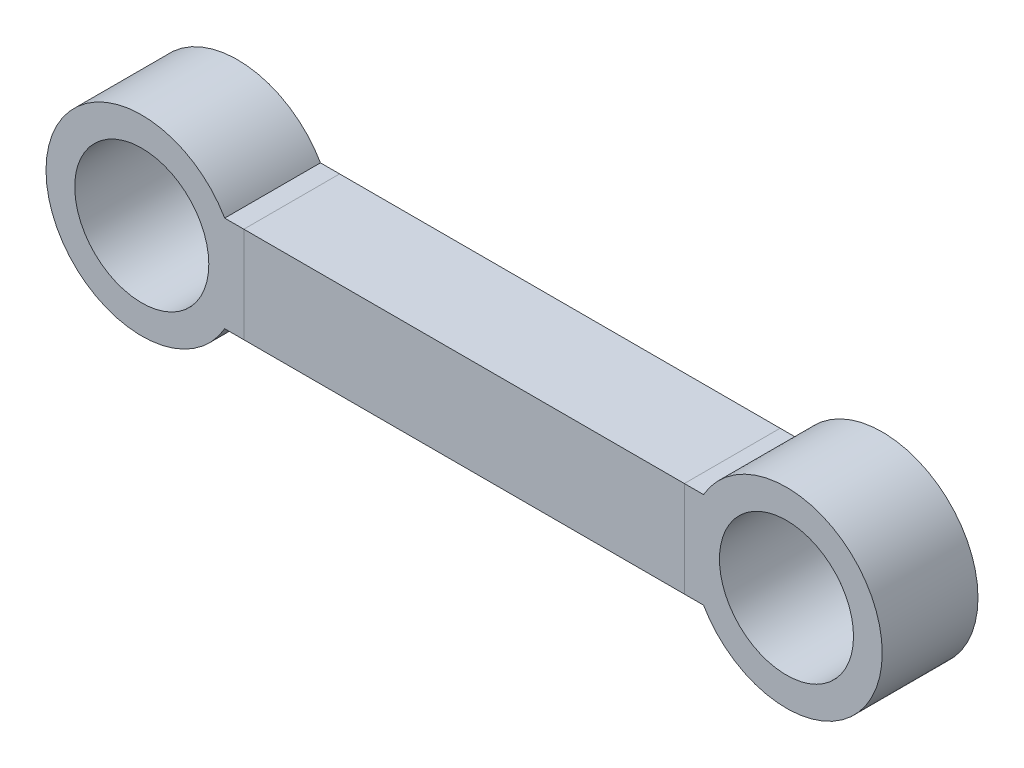
ISO-10303-21;
HEADER;
FILE_DESCRIPTION(('STEP AP214'),'2;1');
FILE_NAME('part.step','',(''),(''),'','','');
FILE_SCHEMA(('AUTOMOTIVE_DESIGN { 1 0 10303 214 1 1 1 1 }'));
ENDSEC;
DATA;
#1=APPLICATION_CONTEXT('core data for automotive mechanical design processes');
#2=APPLICATION_PROTOCOL_DEFINITION('international standard','automotive_design',2000,#1);
#3=PRODUCT_CONTEXT('',#1,'mechanical');
#4=PRODUCT('Part','Part','',(#3));
#5=PRODUCT_RELATED_PRODUCT_CATEGORY('part','',(#4));
#6=PRODUCT_DEFINITION_FORMATION('','',#4);
#7=PRODUCT_DEFINITION_CONTEXT('part definition',#1,'design');
#8=PRODUCT_DEFINITION('design','',#6,#7);
#9=PRODUCT_DEFINITION_SHAPE('','',#8);
#10=(LENGTH_UNIT() NAMED_UNIT(*) SI_UNIT(.MILLI.,.METRE.));
#11=(NAMED_UNIT(*) PLANE_ANGLE_UNIT() SI_UNIT($,.RADIAN.));
#12=(NAMED_UNIT(*) SI_UNIT($,.STERADIAN.) SOLID_ANGLE_UNIT());
#13=UNCERTAINTY_MEASURE_WITH_UNIT(LENGTH_MEASURE(1.E-05),#10,'distance_accuracy_value','');
#14=(GEOMETRIC_REPRESENTATION_CONTEXT(3) GLOBAL_UNCERTAINTY_ASSIGNED_CONTEXT((#13)) GLOBAL_UNIT_ASSIGNED_CONTEXT((#10,
#11,#12)) REPRESENTATION_CONTEXT('',''));
#15=CARTESIAN_POINT('',(0.,0.,0.));
#16=DIRECTION('',(0.,0.,1.));
#17=DIRECTION('',(1.,0.,0.));
#18=AXIS2_PLACEMENT_3D('',#15,#16,#17);
#19=CARTESIAN_POINT('',(23.,0.,10.));
#20=DIRECTION('',(1.,0.,0.));
#21=DIRECTION('',(0.,0.,-1.));
#22=AXIS2_PLACEMENT_3D('',#19,#20,#21);
#23=PLANE('',#22);
#24=DIRECTION('',(0.,-1.,0.));
#25=VECTOR('',#24,1.);
#26=CARTESIAN_POINT('',(23.,0.,0.));
#27=LINE('',#26,#25);
#28=CARTESIAN_POINT('',(23.,5.,0.));
#29=VERTEX_POINT('',#28);
#30=CARTESIAN_POINT('',(23.,-5.,0.));
#31=VERTEX_POINT('',#30);
#32=EDGE_CURVE('E112',#29,#31,#27,.T.);
#33=ORIENTED_EDGE('',*,*,#32,.F.);
#34=DIRECTION('',(0.,0.,-1.));
#35=VECTOR('',#34,1.);
#36=CARTESIAN_POINT('',(23.,5.,10.));
#37=LINE('',#36,#35);
#38=CARTESIAN_POINT('',(23.,5.,10.));
#39=VERTEX_POINT('',#38);
#40=EDGE_CURVE('E12',#39,#29,#37,.T.);
#41=ORIENTED_EDGE('',*,*,#40,.F.);
#42=DIRECTION('',(0.,-1.,0.));
#43=VECTOR('',#42,1.);
#44=CARTESIAN_POINT('',(23.,0.,10.));
#45=LINE('',#44,#43);
#46=CARTESIAN_POINT('',(23.,-5.,10.));
#47=VERTEX_POINT('',#46);
#48=EDGE_CURVE('E106',#39,#47,#45,.T.);
#49=ORIENTED_EDGE('',*,*,#48,.T.);
#50=DIRECTION('',(0.,0.,-1.));
#51=VECTOR('',#50,1.);
#52=CARTESIAN_POINT('',(23.,-5.,10.));
#53=LINE('',#52,#51);
#54=EDGE_CURVE('E64',#47,#31,#53,.T.);
#55=ORIENTED_EDGE('',*,*,#54,.T.);
#56=EDGE_LOOP('',(#33,#41,#49,#55));
#57=FACE_BOUND('',#56,.T.);
#58=ADVANCED_FACE('F48',(#57),#23,.T.);
#59=CARTESIAN_POINT('',(0.,5.,10.));
#60=DIRECTION('',(0.,1.,0.));
#61=DIRECTION('',(-1.,0.,0.));
#62=AXIS2_PLACEMENT_3D('',#59,#60,#61);
#63=PLANE('',#62);
#64=DIRECTION('',(1.,0.,0.));
#65=VECTOR('',#64,1.);
#66=CARTESIAN_POINT('',(0.,5.,0.));
#67=LINE('',#66,#65);
#68=CARTESIAN_POINT('',(-23.,5.,0.));
#69=VERTEX_POINT('',#68);
#70=EDGE_CURVE('E96',#69,#29,#67,.T.);
#71=ORIENTED_EDGE('',*,*,#70,.F.);
#72=DIRECTION('',(0.,0.,-1.));
#73=VECTOR('',#72,1.);
#74=CARTESIAN_POINT('',(-23.,5.,10.));
#75=LINE('',#74,#73);
#76=CARTESIAN_POINT('',(-23.,5.,10.));
#77=VERTEX_POINT('',#76);
#78=EDGE_CURVE('E56',#77,#69,#75,.T.);
#79=ORIENTED_EDGE('',*,*,#78,.F.);
#80=DIRECTION('',(1.,0.,0.));
#81=VECTOR('',#80,1.);
#82=CARTESIAN_POINT('',(0.,5.,10.));
#83=LINE('',#82,#81);
#84=EDGE_CURVE('E94',#77,#39,#83,.T.);
#85=ORIENTED_EDGE('',*,*,#84,.T.);
#86=ORIENTED_EDGE('',*,*,#40,.T.);
#87=EDGE_LOOP('',(#71,#79,#85,#86));
#88=FACE_BOUND('',#87,.T.);
#89=ADVANCED_FACE('F92',(#88),#63,.T.);
#90=CARTESIAN_POINT('',(-23.,0.,10.));
#91=DIRECTION('',(1.,0.,0.));
#92=DIRECTION('',(0.,0.,-1.));
#93=AXIS2_PLACEMENT_3D('',#90,#91,#92);
#94=PLANE('',#93);
#95=DIRECTION('',(0.,-1.,0.));
#96=VECTOR('',#95,1.);
#97=CARTESIAN_POINT('',(-23.,0.,0.));
#98=LINE('',#97,#96);
#99=CARTESIAN_POINT('',(-23.,-5.,0.));
#100=VERTEX_POINT('',#99);
#101=EDGE_CURVE('E115',#69,#100,#98,.T.);
#102=ORIENTED_EDGE('',*,*,#101,.T.);
#103=DIRECTION('',(0.,0.,-1.));
#104=VECTOR('',#103,1.);
#105=CARTESIAN_POINT('',(-23.,-5.,10.));
#106=LINE('',#105,#104);
#107=CARTESIAN_POINT('',(-23.,-5.,10.));
#108=VERTEX_POINT('',#107);
#109=EDGE_CURVE('E78',#108,#100,#106,.T.);
#110=ORIENTED_EDGE('',*,*,#109,.F.);
#111=DIRECTION('',(0.,-1.,0.));
#112=VECTOR('',#111,1.);
#113=CARTESIAN_POINT('',(-23.,0.,10.));
#114=LINE('',#113,#112);
#115=EDGE_CURVE('E99',#77,#108,#114,.T.);
#116=ORIENTED_EDGE('',*,*,#115,.F.);
#117=ORIENTED_EDGE('',*,*,#78,.T.);
#118=EDGE_LOOP('',(#102,#110,#116,#117));
#119=FACE_BOUND('',#118,.T.);
#120=ADVANCED_FACE('F100',(#119),#94,.F.);
#121=CARTESIAN_POINT('',(0.,-5.,10.));
#122=DIRECTION('',(0.,-1.,0.));
#123=DIRECTION('',(0.,0.,-1.));
#124=AXIS2_PLACEMENT_3D('',#121,#122,#123);
#125=PLANE('',#124);
#126=DIRECTION('',(-1.,0.,0.));
#127=VECTOR('',#126,1.);
#128=CARTESIAN_POINT('',(0.,-5.,0.));
#129=LINE('',#128,#127);
#130=EDGE_CURVE('E108',#31,#100,#129,.T.);
#131=ORIENTED_EDGE('',*,*,#130,.F.);
#132=ORIENTED_EDGE('',*,*,#54,.F.);
#133=DIRECTION('',(-1.,0.,0.));
#134=VECTOR('',#133,1.);
#135=CARTESIAN_POINT('',(0.,-5.,10.));
#136=LINE('',#135,#134);
#137=EDGE_CURVE('E103',#47,#108,#136,.T.);
#138=ORIENTED_EDGE('',*,*,#137,.T.);
#139=ORIENTED_EDGE('',*,*,#109,.T.);
#140=EDGE_LOOP('',(#131,#132,#138,#139));
#141=FACE_BOUND('',#140,.T.);
#142=ADVANCED_FACE('F122',(#141),#125,.T.);
#143=CARTESIAN_POINT('',(0.,0.,10.));
#144=DIRECTION('',(0.,0.,1.));
#145=DIRECTION('',(1.,0.,0.));
#146=AXIS2_PLACEMENT_3D('',#143,#144,#145);
#147=PLANE('',#146);
#148=ORIENTED_EDGE('',*,*,#48,.F.);
#149=ORIENTED_EDGE('',*,*,#84,.F.);
#150=ORIENTED_EDGE('',*,*,#115,.T.);
#151=ORIENTED_EDGE('',*,*,#137,.F.);
#152=EDGE_LOOP('',(#148,#149,#150,#151));
#153=FACE_BOUND('',#152,.T.);
#154=ADVANCED_FACE('F105',(#153),#147,.T.);
#155=CARTESIAN_POINT('',(0.,0.,0.));
#156=DIRECTION('',(0.,0.,1.));
#157=DIRECTION('',(1.,0.,0.));
#158=AXIS2_PLACEMENT_3D('',#155,#156,#157);
#159=PLANE('',#158);
#160=ORIENTED_EDGE('',*,*,#32,.T.);
#161=ORIENTED_EDGE('',*,*,#130,.T.);
#162=ORIENTED_EDGE('',*,*,#101,.F.);
#163=ORIENTED_EDGE('',*,*,#70,.T.);
#164=EDGE_LOOP('',(#160,#161,#162,#163));
#165=FACE_BOUND('',#164,.T.);
#166=ADVANCED_FACE('F121',(#165),#159,.F.);
#167=CLOSED_SHELL('',(#58,#89,#120,#142,#154,#166));
#168=MANIFOLD_SOLID_BREP('B2',#167);
#169=CARTESIAN_POINT('',(33.6602540378444,0.,10.));
#170=DIRECTION('',(0.,0.,-1.));
#171=DIRECTION('',(-1.,0.,0.));
#172=AXIS2_PLACEMENT_3D('',#169,#170,#171);
#173=CYLINDRICAL_SURFACE('',#172,10.);
#174=CARTESIAN_POINT('',(33.6602540378444,0.,0.));
#175=DIRECTION('',(0.,0.,1.));
#176=DIRECTION('',(1.,0.,0.));
#177=AXIS2_PLACEMENT_3D('',#174,#175,#176);
#178=CIRCLE('',#177,10.);
#179=CARTESIAN_POINT('',(25.,5.,0.));
#180=VERTEX_POINT('',#179);
#181=CARTESIAN_POINT('',(25.,-5.,0.));
#182=VERTEX_POINT('',#181);
#183=EDGE_CURVE('E250',#180,#182,#178,.F.);
#184=ORIENTED_EDGE('',*,*,#183,.F.);
#185=DIRECTION('',(0.,0.,-1.));
#186=VECTOR('',#185,1.);
#187=CARTESIAN_POINT('',(25.,5.,10.));
#188=LINE('',#187,#186);
#189=CARTESIAN_POINT('',(25.,5.,10.));
#190=VERTEX_POINT('',#189);
#191=EDGE_CURVE('E46',#190,#180,#188,.T.);
#192=ORIENTED_EDGE('',*,*,#191,.F.);
#193=CARTESIAN_POINT('',(33.6602540378444,0.,10.));
#194=DIRECTION('',(0.,0.,1.));
#195=DIRECTION('',(1.,0.,0.));
#196=AXIS2_PLACEMENT_3D('',#193,#194,#195);
#197=CIRCLE('',#196,10.);
#198=CARTESIAN_POINT('',(25.,-5.,10.));
#199=VERTEX_POINT('',#198);
#200=EDGE_CURVE('E240',#190,#199,#197,.F.);
#201=ORIENTED_EDGE('',*,*,#200,.T.);
#202=DIRECTION('',(0.,0.,-1.));
#203=VECTOR('',#202,1.);
#204=CARTESIAN_POINT('',(25.,-5.,10.));
#205=LINE('',#204,#203);
#206=EDGE_CURVE('E198',#199,#182,#205,.T.);
#207=ORIENTED_EDGE('',*,*,#206,.T.);
#208=EDGE_LOOP('',(#184,#192,#201,#207));
#209=FACE_BOUND('',#208,.T.);
#210=ADVANCED_FACE('F181',(#209),#173,.T.);
#211=CARTESIAN_POINT('',(0.,5.,10.));
#212=DIRECTION('',(0.,1.,0.));
#213=DIRECTION('',(-1.,0.,0.));
#214=AXIS2_PLACEMENT_3D('',#211,#212,#213);
#215=PLANE('',#214);
#216=DIRECTION('',(1.,0.,0.));
#217=VECTOR('',#216,1.);
#218=CARTESIAN_POINT('',(0.,5.,0.));
#219=LINE('',#218,#217);
#220=CARTESIAN_POINT('',(23.,5.,0.));
#221=VERTEX_POINT('',#220);
#222=EDGE_CURVE('E230',#221,#180,#219,.T.);
#223=ORIENTED_EDGE('',*,*,#222,.F.);
#224=DIRECTION('',(0.,0.,-1.));
#225=VECTOR('',#224,1.);
#226=CARTESIAN_POINT('',(23.,5.,10.));
#227=LINE('',#226,#225);
#228=CARTESIAN_POINT('',(23.,5.,10.));
#229=VERTEX_POINT('',#228);
#230=EDGE_CURVE('E190',#229,#221,#227,.T.);
#231=ORIENTED_EDGE('',*,*,#230,.F.);
#232=DIRECTION('',(1.,0.,0.));
#233=VECTOR('',#232,1.);
#234=CARTESIAN_POINT('',(0.,5.,10.));
#235=LINE('',#234,#233);
#236=EDGE_CURVE('E228',#229,#190,#235,.T.);
#237=ORIENTED_EDGE('',*,*,#236,.T.);
#238=ORIENTED_EDGE('',*,*,#191,.T.);
#239=EDGE_LOOP('',(#223,#231,#237,#238));
#240=FACE_BOUND('',#239,.T.);
#241=ADVANCED_FACE('F226',(#240),#215,.T.);
#242=CARTESIAN_POINT('',(23.,0.,10.));
#243=DIRECTION('',(1.,0.,0.));
#244=DIRECTION('',(0.,0.,-1.));
#245=AXIS2_PLACEMENT_3D('',#242,#243,#244);
#246=PLANE('',#245);
#247=DIRECTION('',(0.,-1.,0.));
#248=VECTOR('',#247,1.);
#249=CARTESIAN_POINT('',(23.,0.,0.));
#250=LINE('',#249,#248);
#251=CARTESIAN_POINT('',(23.,-5.,0.));
#252=VERTEX_POINT('',#251);
#253=EDGE_CURVE('E253',#221,#252,#250,.T.);
#254=ORIENTED_EDGE('',*,*,#253,.T.);
#255=DIRECTION('',(0.,0.,-1.));
#256=VECTOR('',#255,1.);
#257=CARTESIAN_POINT('',(23.,-5.,10.));
#258=LINE('',#257,#256);
#259=CARTESIAN_POINT('',(23.,-5.,10.));
#260=VERTEX_POINT('',#259);
#261=EDGE_CURVE('E212',#260,#252,#258,.T.);
#262=ORIENTED_EDGE('',*,*,#261,.F.);
#263=DIRECTION('',(0.,-1.,0.));
#264=VECTOR('',#263,1.);
#265=CARTESIAN_POINT('',(23.,0.,10.));
#266=LINE('',#265,#264);
#267=EDGE_CURVE('E233',#229,#260,#266,.T.);
#268=ORIENTED_EDGE('',*,*,#267,.F.);
#269=ORIENTED_EDGE('',*,*,#230,.T.);
#270=EDGE_LOOP('',(#254,#262,#268,#269));
#271=FACE_BOUND('',#270,.T.);
#272=ADVANCED_FACE('F234',(#271),#246,.F.);
#273=CARTESIAN_POINT('',(33.6602540378444,0.,10.));
#274=DIRECTION('',(0.,0.,-1.));
#275=DIRECTION('',(-1.,0.,0.));
#276=AXIS2_PLACEMENT_3D('',#273,#274,#275);
#277=CYLINDRICAL_SURFACE('',#276,7.);
#278=CARTESIAN_POINT('',(33.6602540378444,0.,10.));
#279=DIRECTION('',(0.,0.,1.));
#280=DIRECTION('',(1.,0.,0.));
#281=AXIS2_PLACEMENT_3D('',#278,#279,#280);
#282=CIRCLE('',#281,7.);
#283=CARTESIAN_POINT('',(40.6602540378444,0.,10.));
#284=VERTEX_POINT('',#283);
#285=EDGE_CURVE('E242',#284,#284,#282,.T.);
#286=ORIENTED_EDGE('',*,*,#285,.T.);
#287=EDGE_LOOP('',(#286));
#288=FACE_BOUND('',#287,.T.);
#289=CARTESIAN_POINT('',(33.6602540378444,0.,0.));
#290=DIRECTION('',(0.,0.,1.));
#291=DIRECTION('',(1.,0.,0.));
#292=AXIS2_PLACEMENT_3D('',#289,#290,#291);
#293=CIRCLE('',#292,7.);
#294=CARTESIAN_POINT('',(40.6602540378444,0.,0.));
#295=VERTEX_POINT('',#294);
#296=EDGE_CURVE('E247',#295,#295,#293,.T.);
#297=ORIENTED_EDGE('',*,*,#296,.F.);
#298=EDGE_LOOP('',(#297));
#299=FACE_BOUND('',#298,.T.);
#300=ADVANCED_FACE('F183',(#288,#299),#277,.F.);
#301=CARTESIAN_POINT('',(0.,-5.,10.));
#302=DIRECTION('',(0.,-1.,0.));
#303=DIRECTION('',(0.,0.,-1.));
#304=AXIS2_PLACEMENT_3D('',#301,#302,#303);
#305=PLANE('',#304);
#306=DIRECTION('',(-1.,0.,0.));
#307=VECTOR('',#306,1.);
#308=CARTESIAN_POINT('',(0.,-5.,0.));
#309=LINE('',#308,#307);
#310=EDGE_CURVE('E255',#182,#252,#309,.T.);
#311=ORIENTED_EDGE('',*,*,#310,.F.);
#312=ORIENTED_EDGE('',*,*,#206,.F.);
#313=DIRECTION('',(-1.,0.,0.));
#314=VECTOR('',#313,1.);
#315=CARTESIAN_POINT('',(0.,-5.,10.));
#316=LINE('',#315,#314);
#317=EDGE_CURVE('E237',#199,#260,#316,.T.);
#318=ORIENTED_EDGE('',*,*,#317,.T.);
#319=ORIENTED_EDGE('',*,*,#261,.T.);
#320=EDGE_LOOP('',(#311,#312,#318,#319));
#321=FACE_BOUND('',#320,.T.);
#322=ADVANCED_FACE('F267',(#321),#305,.T.);
#323=CARTESIAN_POINT('',(0.,0.,10.));
#324=DIRECTION('',(0.,0.,1.));
#325=DIRECTION('',(1.,0.,0.));
#326=AXIS2_PLACEMENT_3D('',#323,#324,#325);
#327=PLANE('',#326);
#328=ORIENTED_EDGE('',*,*,#285,.F.);
#329=EDGE_LOOP('',(#328));
#330=FACE_BOUND('',#329,.T.);
#331=ORIENTED_EDGE('',*,*,#200,.F.);
#332=ORIENTED_EDGE('',*,*,#236,.F.);
#333=ORIENTED_EDGE('',*,*,#267,.T.);
#334=ORIENTED_EDGE('',*,*,#317,.F.);
#335=EDGE_LOOP('',(#331,#332,#333,#334));
#336=FACE_BOUND('',#335,.T.);
#337=ADVANCED_FACE('F239',(#330,#336),#327,.T.);
#338=CARTESIAN_POINT('',(0.,0.,0.));
#339=DIRECTION('',(0.,0.,1.));
#340=DIRECTION('',(1.,0.,0.));
#341=AXIS2_PLACEMENT_3D('',#338,#339,#340);
#342=PLANE('',#341);
#343=ORIENTED_EDGE('',*,*,#296,.T.);
#344=EDGE_LOOP('',(#343));
#345=FACE_BOUND('',#344,.T.);
#346=ORIENTED_EDGE('',*,*,#183,.T.);
#347=ORIENTED_EDGE('',*,*,#310,.T.);
#348=ORIENTED_EDGE('',*,*,#253,.F.);
#349=ORIENTED_EDGE('',*,*,#222,.T.);
#350=EDGE_LOOP('',(#346,#347,#348,#349));
#351=FACE_BOUND('',#350,.T.);
#352=ADVANCED_FACE('F266',(#345,#351),#342,.F.);
#353=CLOSED_SHELL('',(#210,#241,#272,#300,#322,#337,#352));
#354=MANIFOLD_SOLID_BREP('B6',#353);
#355=CARTESIAN_POINT('',(0.,5.,10.));
#356=DIRECTION('',(0.,1.,0.));
#357=DIRECTION('',(-1.,0.,0.));
#358=AXIS2_PLACEMENT_3D('',#355,#356,#357);
#359=PLANE('',#358);
#360=DIRECTION('',(1.,0.,0.));
#361=VECTOR('',#360,1.);
#362=CARTESIAN_POINT('',(0.,5.,0.));
#363=LINE('',#362,#361);
#364=CARTESIAN_POINT('',(-25.,5.,0.));
#365=VERTEX_POINT('',#364);
#366=CARTESIAN_POINT('',(-23.,5.,0.));
#367=VERTEX_POINT('',#366);
#368=EDGE_CURVE('E393',#365,#367,#363,.T.);
#369=ORIENTED_EDGE('',*,*,#368,.F.);
#370=DIRECTION('',(0.,0.,-1.));
#371=VECTOR('',#370,1.);
#372=CARTESIAN_POINT('',(-25.,5.,10.));
#373=LINE('',#372,#371);
#374=CARTESIAN_POINT('',(-25.,5.,10.));
#375=VERTEX_POINT('',#374);
#376=EDGE_CURVE('E179',#375,#365,#373,.T.);
#377=ORIENTED_EDGE('',*,*,#376,.F.);
#378=DIRECTION('',(1.,0.,0.));
#379=VECTOR('',#378,1.);
#380=CARTESIAN_POINT('',(0.,5.,10.));
#381=LINE('',#380,#379);
#382=CARTESIAN_POINT('',(-23.,5.,10.));
#383=VERTEX_POINT('',#382);
#384=EDGE_CURVE('E375',#375,#383,#381,.T.);
#385=ORIENTED_EDGE('',*,*,#384,.T.);
#386=DIRECTION('',(0.,0.,-1.));
#387=VECTOR('',#386,1.);
#388=CARTESIAN_POINT('',(-23.,5.,10.));
#389=LINE('',#388,#387);
#390=EDGE_CURVE('E343',#383,#367,#389,.T.);
#391=ORIENTED_EDGE('',*,*,#390,.T.);
#392=EDGE_LOOP('',(#369,#377,#385,#391));
#393=FACE_BOUND('',#392,.T.);
#394=ADVANCED_FACE('F326',(#393),#359,.T.);
#395=CARTESIAN_POINT('',(-33.6602540378444,0.,10.));
#396=DIRECTION('',(0.,0.,-1.));
#397=DIRECTION('',(-1.,0.,0.));
#398=AXIS2_PLACEMENT_3D('',#395,#396,#397);
#399=CYLINDRICAL_SURFACE('',#398,10.);
#400=CARTESIAN_POINT('',(-33.6602540378444,0.,0.));
#401=DIRECTION('',(0.,0.,1.));
#402=DIRECTION('',(1.,0.,0.));
#403=AXIS2_PLACEMENT_3D('',#400,#401,#402);
#404=CIRCLE('',#403,10.);
#405=CARTESIAN_POINT('',(-25.,-5.,0.));
#406=VERTEX_POINT('',#405);
#407=EDGE_CURVE('E381',#365,#406,#404,.T.);
#408=ORIENTED_EDGE('',*,*,#407,.T.);
#409=DIRECTION('',(0.,0.,-1.));
#410=VECTOR('',#409,1.);
#411=CARTESIAN_POINT('',(-25.,-5.,10.));
#412=LINE('',#411,#410);
#413=CARTESIAN_POINT('',(-25.,-5.,10.));
#414=VERTEX_POINT('',#413);
#415=EDGE_CURVE('E335',#414,#406,#412,.T.);
#416=ORIENTED_EDGE('',*,*,#415,.F.);
#417=CARTESIAN_POINT('',(-33.6602540378444,0.,10.));
#418=DIRECTION('',(0.,0.,1.));
#419=DIRECTION('',(1.,0.,0.));
#420=AXIS2_PLACEMENT_3D('',#417,#418,#419);
#421=CIRCLE('',#420,10.);
#422=EDGE_CURVE('E369',#375,#414,#421,.T.);
#423=ORIENTED_EDGE('',*,*,#422,.F.);
#424=ORIENTED_EDGE('',*,*,#376,.T.);
#425=EDGE_LOOP('',(#408,#416,#423,#424));
#426=FACE_BOUND('',#425,.T.);
#427=ADVANCED_FACE('F379',(#426),#399,.T.);
#428=CARTESIAN_POINT('',(0.,-5.,10.));
#429=DIRECTION('',(0.,-1.,0.));
#430=DIRECTION('',(0.,0.,-1.));
#431=AXIS2_PLACEMENT_3D('',#428,#429,#430);
#432=PLANE('',#431);
#433=DIRECTION('',(-1.,0.,0.));
#434=VECTOR('',#433,1.);
#435=CARTESIAN_POINT('',(0.,-5.,0.));
#436=LINE('',#435,#434);
#437=CARTESIAN_POINT('',(-23.,-5.,0.));
#438=VERTEX_POINT('',#437);
#439=EDGE_CURVE('E396',#438,#406,#436,.T.);
#440=ORIENTED_EDGE('',*,*,#439,.F.);
#441=DIRECTION('',(0.,0.,-1.));
#442=VECTOR('',#441,1.);
#443=CARTESIAN_POINT('',(-23.,-5.,10.));
#444=LINE('',#443,#442);
#445=CARTESIAN_POINT('',(-23.,-5.,10.));
#446=VERTEX_POINT('',#445);
#447=EDGE_CURVE('E356',#446,#438,#444,.T.);
#448=ORIENTED_EDGE('',*,*,#447,.F.);
#449=DIRECTION('',(-1.,0.,0.));
#450=VECTOR('',#449,1.);
#451=CARTESIAN_POINT('',(0.,-5.,10.));
#452=LINE('',#451,#450);
#453=EDGE_CURVE('E374',#446,#414,#452,.T.);
#454=ORIENTED_EDGE('',*,*,#453,.T.);
#455=ORIENTED_EDGE('',*,*,#415,.T.);
#456=EDGE_LOOP('',(#440,#448,#454,#455));
#457=FACE_BOUND('',#456,.T.);
#458=ADVANCED_FACE('F384',(#457),#432,.T.);
#459=CARTESIAN_POINT('',(-33.6602540378444,0.,10.));
#460=DIRECTION('',(0.,0.,-1.));
#461=DIRECTION('',(-1.,0.,0.));
#462=AXIS2_PLACEMENT_3D('',#459,#460,#461);
#463=CYLINDRICAL_SURFACE('',#462,7.);
#464=CARTESIAN_POINT('',(-33.6602540378444,0.,10.));
#465=DIRECTION('',(0.,0.,1.));
#466=DIRECTION('',(1.,0.,0.));
#467=AXIS2_PLACEMENT_3D('',#464,#465,#466);
#468=CIRCLE('',#467,7.);
#469=CARTESIAN_POINT('',(-26.6602540378444,0.,10.));
#470=VERTEX_POINT('',#469);
#471=EDGE_CURVE('E401',#470,#470,#468,.T.);
#472=ORIENTED_EDGE('',*,*,#471,.T.);
#473=EDGE_LOOP('',(#472));
#474=FACE_BOUND('',#473,.T.);
#475=CARTESIAN_POINT('',(-33.6602540378444,0.,0.));
#476=DIRECTION('',(0.,0.,1.));
#477=DIRECTION('',(1.,0.,0.));
#478=AXIS2_PLACEMENT_3D('',#475,#476,#477);
#479=CIRCLE('',#478,7.);
#480=CARTESIAN_POINT('',(-26.6602540378444,0.,0.));
#481=VERTEX_POINT('',#480);
#482=EDGE_CURVE('E390',#481,#481,#479,.T.);
#483=ORIENTED_EDGE('',*,*,#482,.F.);
#484=EDGE_LOOP('',(#483));
#485=FACE_BOUND('',#484,.T.);
#486=ADVANCED_FACE('F328',(#474,#485),#463,.F.);
#487=CARTESIAN_POINT('',(-23.,0.,10.));
#488=DIRECTION('',(1.,0.,0.));
#489=DIRECTION('',(0.,0.,-1.));
#490=AXIS2_PLACEMENT_3D('',#487,#488,#489);
#491=PLANE('',#490);
#492=DIRECTION('',(0.,-1.,0.));
#493=VECTOR('',#492,1.);
#494=CARTESIAN_POINT('',(-23.,0.,0.));
#495=LINE('',#494,#493);
#496=EDGE_CURVE('E398',#367,#438,#495,.T.);
#497=ORIENTED_EDGE('',*,*,#496,.F.);
#498=ORIENTED_EDGE('',*,*,#390,.F.);
#499=DIRECTION('',(0.,-1.,0.));
#500=VECTOR('',#499,1.);
#501=CARTESIAN_POINT('',(-23.,0.,10.));
#502=LINE('',#501,#500);
#503=EDGE_CURVE('E385',#383,#446,#502,.T.);
#504=ORIENTED_EDGE('',*,*,#503,.T.);
#505=ORIENTED_EDGE('',*,*,#447,.T.);
#506=EDGE_LOOP('',(#497,#498,#504,#505));
#507=FACE_BOUND('',#506,.T.);
#508=ADVANCED_FACE('F408',(#507),#491,.T.);
#509=CARTESIAN_POINT('',(0.,0.,10.));
#510=DIRECTION('',(0.,0.,1.));
#511=DIRECTION('',(1.,0.,0.));
#512=AXIS2_PLACEMENT_3D('',#509,#510,#511);
#513=PLANE('',#512);
#514=ORIENTED_EDGE('',*,*,#471,.F.);
#515=EDGE_LOOP('',(#514));
#516=FACE_BOUND('',#515,.T.);
#517=ORIENTED_EDGE('',*,*,#384,.F.);
#518=ORIENTED_EDGE('',*,*,#422,.T.);
#519=ORIENTED_EDGE('',*,*,#453,.F.);
#520=ORIENTED_EDGE('',*,*,#503,.F.);
#521=EDGE_LOOP('',(#517,#518,#519,#520));
#522=FACE_BOUND('',#521,.T.);
#523=ADVANCED_FACE('F371',(#516,#522),#513,.T.);
#524=CARTESIAN_POINT('',(0.,0.,0.));
#525=DIRECTION('',(0.,0.,1.));
#526=DIRECTION('',(1.,0.,0.));
#527=AXIS2_PLACEMENT_3D('',#524,#525,#526);
#528=PLANE('',#527);
#529=ORIENTED_EDGE('',*,*,#482,.T.);
#530=EDGE_LOOP('',(#529));
#531=FACE_BOUND('',#530,.T.);
#532=ORIENTED_EDGE('',*,*,#368,.T.);
#533=ORIENTED_EDGE('',*,*,#496,.T.);
#534=ORIENTED_EDGE('',*,*,#439,.T.);
#535=ORIENTED_EDGE('',*,*,#407,.F.);
#536=EDGE_LOOP('',(#532,#533,#534,#535));
#537=FACE_BOUND('',#536,.T.);
#538=ADVANCED_FACE('F415',(#531,#537),#528,.F.);
#539=CLOSED_SHELL('',(#394,#427,#458,#486,#508,#523,#538));
#540=MANIFOLD_SOLID_BREP('B40',#539);
#541=ADVANCED_BREP_SHAPE_REPRESENTATION('',(#18,#168,#354,#540),#14);
#542=SHAPE_DEFINITION_REPRESENTATION(#9,#541);
ENDSEC;
END-ISO-10303-21;
